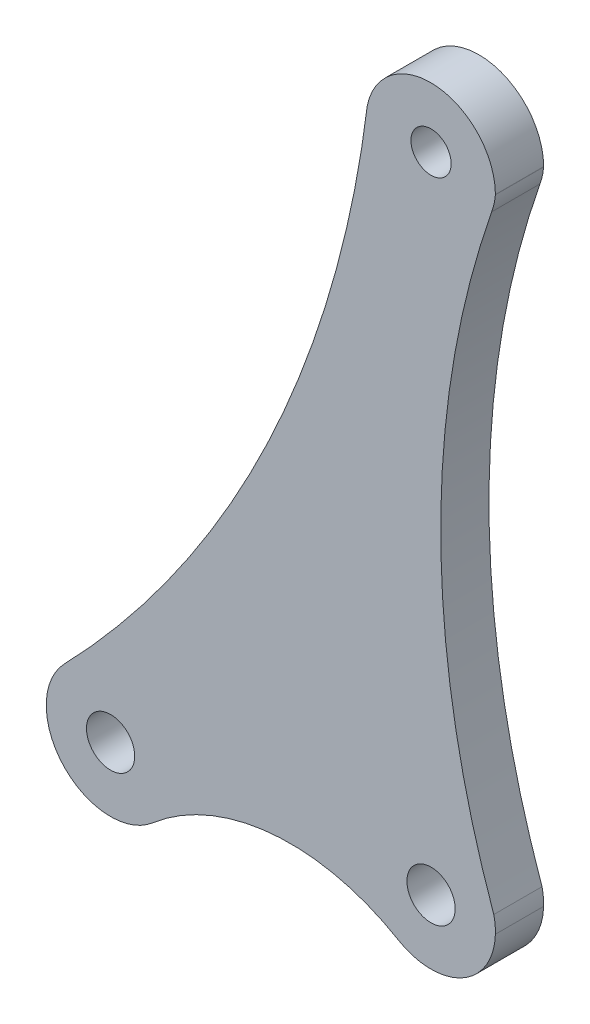
ISO-10303-21;
HEADER;
FILE_DESCRIPTION(('STEP AP214'),'2;1');
FILE_NAME('part.step','',(''),(''),'','','');
FILE_SCHEMA(('AUTOMOTIVE_DESIGN { 1 0 10303 214 1 1 1 1 }'));
ENDSEC;
DATA;
#1=APPLICATION_CONTEXT('core data for automotive mechanical design processes');
#2=APPLICATION_PROTOCOL_DEFINITION('international standard','automotive_design',2000,#1);
#3=PRODUCT_CONTEXT('',#1,'mechanical');
#4=PRODUCT('Part','Part','',(#3));
#5=PRODUCT_RELATED_PRODUCT_CATEGORY('part','',(#4));
#6=PRODUCT_DEFINITION_FORMATION('','',#4);
#7=PRODUCT_DEFINITION_CONTEXT('part definition',#1,'design');
#8=PRODUCT_DEFINITION('design','',#6,#7);
#9=PRODUCT_DEFINITION_SHAPE('','',#8);
#10=(LENGTH_UNIT() NAMED_UNIT(*) SI_UNIT(.MILLI.,.METRE.));
#11=(NAMED_UNIT(*) PLANE_ANGLE_UNIT() SI_UNIT($,.RADIAN.));
#12=(NAMED_UNIT(*) SI_UNIT($,.STERADIAN.) SOLID_ANGLE_UNIT());
#13=UNCERTAINTY_MEASURE_WITH_UNIT(LENGTH_MEASURE(1.E-05),#10,'distance_accuracy_value','');
#14=(GEOMETRIC_REPRESENTATION_CONTEXT(3) GLOBAL_UNCERTAINTY_ASSIGNED_CONTEXT((#13)) GLOBAL_UNIT_ASSIGNED_CONTEXT((#10,
#11,#12)) REPRESENTATION_CONTEXT('',''));
#15=CARTESIAN_POINT('',(0.,0.,0.));
#16=DIRECTION('',(0.,0.,1.));
#17=DIRECTION('',(1.,0.,0.));
#18=AXIS2_PLACEMENT_3D('',#15,#16,#17);
#19=CARTESIAN_POINT('',(2166.51564922467,1590.35932652657,3.));
#20=DIRECTION('',(0.,0.,1.));
#21=DIRECTION('',(1.,0.,0.));
#22=AXIS2_PLACEMENT_3D('',#19,#20,#21);
#23=PLANE('',#22);
#24=CARTESIAN_POINT('',(2186.43959387212,1592.10228841253,3.));
#25=DIRECTION('',(0.,0.,1.));
#26=DIRECTION('',(1.,0.,0.));
#27=AXIS2_PLACEMENT_3D('',#24,#25,#26);
#28=CIRCLE('',#27,1.50000000000011);
#29=CARTESIAN_POINT('',(2187.93959387212,1592.10228841253,3.));
#30=VERTEX_POINT('',#29);
#31=EDGE_CURVE('E310',#30,#30,#28,.T.);
#32=ORIENTED_EDGE('',*,*,#31,.F.);
#33=EDGE_LOOP('',(#32));
#34=FACE_BOUND('',#33,.T.);
#35=CARTESIAN_POINT('',(2166.51561549755,1590.35926949553,3.));
#36=DIRECTION('',(0.,0.,1.));
#37=DIRECTION('',(1.,0.,0.));
#38=AXIS2_PLACEMENT_3D('',#35,#36,#37);
#39=CIRCLE('',#38,3.99995557073102);
#40=CARTESIAN_POINT('',(2163.63933697027,1593.13895767973,3.));
#41=VERTEX_POINT('',#40);
#42=CARTESIAN_POINT('',(2165.28484492983,1586.5533729681,3.));
#43=VERTEX_POINT('',#42);
#44=EDGE_CURVE('E191',#41,#43,#39,.T.);
#45=ORIENTED_EDGE('',*,*,#44,.T.);
#46=CARTESIAN_POINT('',(2166.5156829518,1590.35938355762,3.));
#47=DIRECTION('',(0.,0.,1.));
#48=DIRECTION('',(1.,0.,0.));
#49=AXIS2_PLACEMENT_3D('',#46,#47,#48);
#50=CIRCLE('',#49,4.00008485457964);
#51=CARTESIAN_POINT('',(2166.26470953821,1586.36717975652,3.));
#52=VERTEX_POINT('',#51);
#53=EDGE_CURVE('E109',#43,#52,#50,.T.);
#54=ORIENTED_EDGE('',*,*,#53,.T.);
#55=CARTESIAN_POINT('',(2166.51567116008,1590.35932150316,3.));
#56=DIRECTION('',(0.,0.,1.));
#57=DIRECTION('',(1.,0.,0.));
#58=AXIS2_PLACEMENT_3D('',#55,#56,#57);
#59=CIRCLE('',#58,4.00002218255141);
#60=CARTESIAN_POINT('',(2169.12214239934,1587.32510247023,3.));
#61=VERTEX_POINT('',#60);
#62=EDGE_CURVE('E224',#52,#61,#59,.T.);
#63=ORIENTED_EDGE('',*,*,#62,.T.);
#64=CARTESIAN_POINT('',(2177.69207682142,1577.34922461556,3.));
#65=DIRECTION('',(0.,0.,-1.));
#66=DIRECTION('',(1.,0.,0.));
#67=AXIS2_PLACEMENT_3D('',#64,#65,#66);
#68=CIRCLE('',#67,13.1514985826706);
#69=CARTESIAN_POINT('',(2184.39948642041,1588.66172086712,3.));
#70=VERTEX_POINT('',#69);
#71=EDGE_CURVE('E244',#61,#70,#68,.T.);
#72=ORIENTED_EDGE('',*,*,#71,.T.);
#73=CARTESIAN_POINT('',(2186.43997622529,1592.10454572208,3.));
#74=DIRECTION('',(0.,0.,1.));
#75=DIRECTION('',(1.,0.,0.));
#76=AXIS2_PLACEMENT_3D('',#73,#74,#75);
#77=CIRCLE('',#76,4.00207966259663);
#78=CARTESIAN_POINT('',(2190.44035000705,1591.98770723522,3.));
#79=VERTEX_POINT('',#78);
#80=EDGE_CURVE('E240',#70,#79,#77,.T.);
#81=ORIENTED_EDGE('',*,*,#80,.T.);
#82=CARTESIAN_POINT('',(2186.43955065192,1592.10247620143,3.));
#83=DIRECTION('',(0.,0.,1.));
#84=DIRECTION('',(1.,0.,0.));
#85=AXIS2_PLACEMENT_3D('',#82,#83,#84);
#86=CIRCLE('',#85,4.0024451770855);
#87=CARTESIAN_POINT('',(2190.34004545616,1593.00008841039,3.));
#88=VERTEX_POINT('',#87);
#89=EDGE_CURVE('E243',#79,#88,#86,.T.);
#90=ORIENTED_EDGE('',*,*,#89,.T.);
#91=CARTESIAN_POINT('',(2243.80207840162,1612.06747574487,3.));
#92=DIRECTION('',(0.,0.,-1.));
#93=DIRECTION('',(1.,0.,0.));
#94=AXIS2_PLACEMENT_3D('',#91,#92,#93);
#95=CIRCLE('',#94,56.7604988211369);
#96=CARTESIAN_POINT('',(2190.21180157483,1630.77139127217,3.));
#97=VERTEX_POINT('',#96);
#98=EDGE_CURVE('E248',#88,#97,#95,.T.);
#99=ORIENTED_EDGE('',*,*,#98,.T.);
#100=CARTESIAN_POINT('',(2186.43211129498,1632.15147021275,3.));
#101=DIRECTION('',(0.,0.,1.));
#102=DIRECTION('',(1.,0.,0.));
#103=AXIS2_PLACEMENT_3D('',#100,#101,#102);
#104=CIRCLE('',#103,4.02376397094073);
#105=CARTESIAN_POINT('',(2190.4405541763,1631.8006680449,3.));
#106=VERTEX_POINT('',#105);
#107=EDGE_CURVE('E137',#97,#106,#104,.T.);
#108=ORIENTED_EDGE('',*,*,#107,.T.);
#109=CARTESIAN_POINT('',(2190.3430415378,1631.80920194347,3.));
#110=DIRECTION('',(0.,0.,1.));
#111=DIRECTION('',(-1.,0.,0.));
#112=AXIS2_PLACEMENT_3D('',#109,#110,#111);
#113=CIRCLE('',#112,0.0978853517741694);
#114=CARTESIAN_POINT('',(2190.4405541763,1631.81773584204,3.));
#115=VERTEX_POINT('',#114);
#116=EDGE_CURVE('E131',#106,#115,#113,.T.);
#117=ORIENTED_EDGE('',*,*,#116,.T.);
#118=CARTESIAN_POINT('',(2186.41679925504,1631.80920194346,3.));
#119=DIRECTION('',(0.,0.,1.));
#120=DIRECTION('',(1.,0.,0.));
#121=AXIS2_PLACEMENT_3D('',#118,#119,#120);
#122=CIRCLE('',#121,4.02376397094032);
#123=CARTESIAN_POINT('',(2182.46970368957,1632.59093916972,3.));
#124=VERTEX_POINT('',#123);
#125=EDGE_CURVE('E135',#115,#124,#122,.T.);
#126=ORIENTED_EDGE('',*,*,#125,.T.);
#127=CARTESIAN_POINT('',(2114.09650632209,1641.00551279893,3.));
#128=DIRECTION('',(0.,0.,-1.));
#129=DIRECTION('',(1.,0.,0.));
#130=AXIS2_PLACEMENT_3D('',#127,#128,#129);
#131=CIRCLE('',#130,68.8890351769731);
#132=EDGE_CURVE('E57',#124,#41,#131,.T.);
#133=ORIENTED_EDGE('',*,*,#132,.T.);
#134=EDGE_LOOP('',(#45,#54,#63,#72,#81,#90,#99,#108,#117,#126,#133));
#135=FACE_BOUND('',#134,.T.);
#136=CARTESIAN_POINT('',(2166.51565662402,1590.35938521265,3.));
#137=DIRECTION('',(0.,0.,1.));
#138=DIRECTION('',(1.,0.,0.));
#139=AXIS2_PLACEMENT_3D('',#136,#137,#138);
#140=CIRCLE('',#139,1.50000000000011);
#141=CARTESIAN_POINT('',(2168.01565662402,1590.35938521265,3.));
#142=VERTEX_POINT('',#141);
#143=EDGE_CURVE('E164',#142,#142,#140,.T.);
#144=ORIENTED_EDGE('',*,*,#143,.F.);
#145=EDGE_LOOP('',(#144));
#146=FACE_BOUND('',#145,.T.);
#147=CARTESIAN_POINT('',(2186.43971661617,1632.1023319251,3.));
#148=DIRECTION('',(0.,0.,1.));
#149=DIRECTION('',(1.,0.,0.));
#150=AXIS2_PLACEMENT_3D('',#147,#148,#149);
#151=CIRCLE('',#150,1.25000000000008);
#152=CARTESIAN_POINT('',(2187.68971661617,1632.1023319251,3.));
#153=VERTEX_POINT('',#152);
#154=EDGE_CURVE('E299',#153,#153,#151,.T.);
#155=ORIENTED_EDGE('',*,*,#154,.F.);
#156=EDGE_LOOP('',(#155));
#157=FACE_BOUND('',#156,.T.);
#158=ADVANCED_FACE('F39',(#34,#135,#146,#157),#23,.T.);
#159=CARTESIAN_POINT('',(2166.51564922467,1590.35932652657,0.));
#160=DIRECTION('',(0.,0.,1.));
#161=DIRECTION('',(1.,0.,0.));
#162=AXIS2_PLACEMENT_3D('',#159,#160,#161);
#163=PLANE('',#162);
#164=CARTESIAN_POINT('',(2166.51561549755,1590.35926949553,0.));
#165=DIRECTION('',(0.,0.,1.));
#166=DIRECTION('',(1.,0.,0.));
#167=AXIS2_PLACEMENT_3D('',#164,#165,#166);
#168=CIRCLE('',#167,3.99995557073102);
#169=CARTESIAN_POINT('',(2163.63933697027,1593.13895767973,0.));
#170=VERTEX_POINT('',#169);
#171=CARTESIAN_POINT('',(2165.28484492983,1586.5533729681,0.));
#172=VERTEX_POINT('',#171);
#173=EDGE_CURVE('E159',#170,#172,#168,.T.);
#174=ORIENTED_EDGE('',*,*,#173,.F.);
#175=CARTESIAN_POINT('',(2114.09650632209,1641.00551279893,0.));
#176=DIRECTION('',(0.,0.,-1.));
#177=DIRECTION('',(1.,0.,0.));
#178=AXIS2_PLACEMENT_3D('',#175,#176,#177);
#179=CIRCLE('',#178,68.8890351769731);
#180=CARTESIAN_POINT('',(2182.46970368957,1632.59093916972,0.));
#181=VERTEX_POINT('',#180);
#182=EDGE_CURVE('E101',#181,#170,#179,.T.);
#183=ORIENTED_EDGE('',*,*,#182,.F.);
#184=CARTESIAN_POINT('',(2186.41679925504,1631.80920194346,0.));
#185=DIRECTION('',(0.,0.,1.));
#186=DIRECTION('',(1.,0.,0.));
#187=AXIS2_PLACEMENT_3D('',#184,#185,#186);
#188=CIRCLE('',#187,4.02376397094032);
#189=CARTESIAN_POINT('',(2190.4405541763,1631.81773584204,0.));
#190=VERTEX_POINT('',#189);
#191=EDGE_CURVE('E95',#190,#181,#188,.T.);
#192=ORIENTED_EDGE('',*,*,#191,.F.);
#193=CARTESIAN_POINT('',(2190.3430415378,1631.80920194347,0.));
#194=DIRECTION('',(0.,0.,1.));
#195=DIRECTION('',(-1.,0.,0.));
#196=AXIS2_PLACEMENT_3D('',#193,#194,#195);
#197=CIRCLE('',#196,0.0978853517741694);
#198=CARTESIAN_POINT('',(2190.4405541763,1631.8006680449,0.));
#199=VERTEX_POINT('',#198);
#200=EDGE_CURVE('E146',#199,#190,#197,.T.);
#201=ORIENTED_EDGE('',*,*,#200,.F.);
#202=CARTESIAN_POINT('',(2186.43211129498,1632.15147021275,0.));
#203=DIRECTION('',(0.,0.,1.));
#204=DIRECTION('',(1.,0.,0.));
#205=AXIS2_PLACEMENT_3D('',#202,#203,#204);
#206=CIRCLE('',#205,4.02376397094073);
#207=CARTESIAN_POINT('',(2190.21180157483,1630.77139127217,0.));
#208=VERTEX_POINT('',#207);
#209=EDGE_CURVE('E182',#208,#199,#206,.T.);
#210=ORIENTED_EDGE('',*,*,#209,.F.);
#211=CARTESIAN_POINT('',(2243.80207840162,1612.06747574487,0.));
#212=DIRECTION('',(0.,0.,-1.));
#213=DIRECTION('',(1.,0.,0.));
#214=AXIS2_PLACEMENT_3D('',#211,#212,#213);
#215=CIRCLE('',#214,56.7604988211369);
#216=CARTESIAN_POINT('',(2190.34004545616,1593.00008841039,0.));
#217=VERTEX_POINT('',#216);
#218=EDGE_CURVE('E179',#217,#208,#215,.T.);
#219=ORIENTED_EDGE('',*,*,#218,.F.);
#220=CARTESIAN_POINT('',(2186.43955065192,1592.10247620143,0.));
#221=DIRECTION('',(0.,0.,1.));
#222=DIRECTION('',(1.,0.,0.));
#223=AXIS2_PLACEMENT_3D('',#220,#221,#222);
#224=CIRCLE('',#223,4.0024451770855);
#225=CARTESIAN_POINT('',(2190.44035000705,1591.98770723522,0.));
#226=VERTEX_POINT('',#225);
#227=EDGE_CURVE('E176',#226,#217,#224,.T.);
#228=ORIENTED_EDGE('',*,*,#227,.F.);
#229=CARTESIAN_POINT('',(2186.43997622529,1592.10454572208,0.));
#230=DIRECTION('',(0.,0.,1.));
#231=DIRECTION('',(1.,0.,0.));
#232=AXIS2_PLACEMENT_3D('',#229,#230,#231);
#233=CIRCLE('',#232,4.00207966259663);
#234=CARTESIAN_POINT('',(2184.39948642041,1588.66172086712,0.));
#235=VERTEX_POINT('',#234);
#236=EDGE_CURVE('E173',#235,#226,#233,.T.);
#237=ORIENTED_EDGE('',*,*,#236,.F.);
#238=CARTESIAN_POINT('',(2177.69207682142,1577.34922461556,0.));
#239=DIRECTION('',(0.,0.,-1.));
#240=DIRECTION('',(1.,0.,0.));
#241=AXIS2_PLACEMENT_3D('',#238,#239,#240);
#242=CIRCLE('',#241,13.1514985826706);
#243=CARTESIAN_POINT('',(2169.12214239934,1587.32510247023,0.));
#244=VERTEX_POINT('',#243);
#245=EDGE_CURVE('E170',#244,#235,#242,.T.);
#246=ORIENTED_EDGE('',*,*,#245,.F.);
#247=CARTESIAN_POINT('',(2166.51567116008,1590.35932150316,0.));
#248=DIRECTION('',(0.,0.,1.));
#249=DIRECTION('',(1.,0.,0.));
#250=AXIS2_PLACEMENT_3D('',#247,#248,#249);
#251=CIRCLE('',#250,4.00002218255141);
#252=CARTESIAN_POINT('',(2166.26470953821,1586.36717975652,0.));
#253=VERTEX_POINT('',#252);
#254=EDGE_CURVE('E167',#253,#244,#251,.T.);
#255=ORIENTED_EDGE('',*,*,#254,.F.);
#256=CARTESIAN_POINT('',(2166.5156829518,1590.35938355762,0.));
#257=DIRECTION('',(0.,0.,1.));
#258=DIRECTION('',(1.,0.,0.));
#259=AXIS2_PLACEMENT_3D('',#256,#257,#258);
#260=CIRCLE('',#259,4.00008485457964);
#261=EDGE_CURVE('E163',#172,#253,#260,.T.);
#262=ORIENTED_EDGE('',*,*,#261,.F.);
#263=EDGE_LOOP('',(#174,#183,#192,#201,#210,#219,#228,#237,#246,#255,#262));
#264=FACE_BOUND('',#263,.T.);
#265=CARTESIAN_POINT('',(2166.51565662402,1590.35938521265,0.));
#266=DIRECTION('',(0.,0.,1.));
#267=DIRECTION('',(1.,0.,0.));
#268=AXIS2_PLACEMENT_3D('',#265,#266,#267);
#269=CIRCLE('',#268,1.50000000000011);
#270=CARTESIAN_POINT('',(2168.01565662402,1590.35938521265,0.));
#271=VERTEX_POINT('',#270);
#272=EDGE_CURVE('E314',#271,#271,#269,.T.);
#273=ORIENTED_EDGE('',*,*,#272,.T.);
#274=EDGE_LOOP('',(#273));
#275=FACE_BOUND('',#274,.T.);
#276=CARTESIAN_POINT('',(2186.43959387212,1592.10228841253,0.));
#277=DIRECTION('',(0.,0.,1.));
#278=DIRECTION('',(1.,0.,0.));
#279=AXIS2_PLACEMENT_3D('',#276,#277,#278);
#280=CIRCLE('',#279,1.50000000000011);
#281=CARTESIAN_POINT('',(2187.93959387212,1592.10228841253,0.));
#282=VERTEX_POINT('',#281);
#283=EDGE_CURVE('E307',#282,#282,#280,.T.);
#284=ORIENTED_EDGE('',*,*,#283,.T.);
#285=EDGE_LOOP('',(#284));
#286=FACE_BOUND('',#285,.T.);
#287=CARTESIAN_POINT('',(2186.43971661617,1632.1023319251,0.));
#288=DIRECTION('',(0.,0.,1.));
#289=DIRECTION('',(1.,0.,0.));
#290=AXIS2_PLACEMENT_3D('',#287,#288,#289);
#291=CIRCLE('',#290,1.25000000000008);
#292=CARTESIAN_POINT('',(2187.68971661617,1632.1023319251,0.));
#293=VERTEX_POINT('',#292);
#294=EDGE_CURVE('E302',#293,#293,#291,.T.);
#295=ORIENTED_EDGE('',*,*,#294,.T.);
#296=EDGE_LOOP('',(#295));
#297=FACE_BOUND('',#296,.T.);
#298=ADVANCED_FACE('F228',(#264,#275,#286,#297),#163,.F.);
#299=CARTESIAN_POINT('',(2166.51561549755,1590.35926949553,3.));
#300=DIRECTION('',(0.,0.,-1.));
#301=DIRECTION('',(-1.,0.,0.));
#302=AXIS2_PLACEMENT_3D('',#299,#300,#301);
#303=CYLINDRICAL_SURFACE('',#302,3.99995557073102);
#304=ORIENTED_EDGE('',*,*,#173,.T.);
#305=DIRECTION('',(0.,0.,-1.));
#306=VECTOR('',#305,1.);
#307=CARTESIAN_POINT('',(2165.28484492983,1586.5533729681,3.));
#308=LINE('',#307,#306);
#309=EDGE_CURVE('E11',#43,#172,#308,.T.);
#310=ORIENTED_EDGE('',*,*,#309,.F.);
#311=ORIENTED_EDGE('',*,*,#44,.F.);
#312=DIRECTION('',(0.,0.,-1.));
#313=VECTOR('',#312,1.);
#314=CARTESIAN_POINT('',(2163.63933697027,1593.13895767973,3.));
#315=LINE('',#314,#313);
#316=EDGE_CURVE('E155',#41,#170,#315,.T.);
#317=ORIENTED_EDGE('',*,*,#316,.T.);
#318=EDGE_LOOP('',(#304,#310,#311,#317));
#319=FACE_BOUND('',#318,.T.);
#320=ADVANCED_FACE('F41',(#319),#303,.T.);
#321=CARTESIAN_POINT('',(2166.5156829518,1590.35938355762,3.));
#322=DIRECTION('',(0.,0.,-1.));
#323=DIRECTION('',(-1.,0.,0.));
#324=AXIS2_PLACEMENT_3D('',#321,#322,#323);
#325=CYLINDRICAL_SURFACE('',#324,4.00008485457964);
#326=ORIENTED_EDGE('',*,*,#261,.T.);
#327=DIRECTION('',(0.,0.,-1.));
#328=VECTOR('',#327,1.);
#329=CARTESIAN_POINT('',(2166.26470953821,1586.36717975652,3.));
#330=LINE('',#329,#328);
#331=EDGE_CURVE('E49',#52,#253,#330,.T.);
#332=ORIENTED_EDGE('',*,*,#331,.F.);
#333=ORIENTED_EDGE('',*,*,#53,.F.);
#334=ORIENTED_EDGE('',*,*,#309,.T.);
#335=EDGE_LOOP('',(#326,#332,#333,#334));
#336=FACE_BOUND('',#335,.T.);
#337=ADVANCED_FACE('F412',(#336),#325,.T.);
#338=CARTESIAN_POINT('',(2166.51567116008,1590.35932150316,3.));
#339=DIRECTION('',(0.,0.,-1.));
#340=DIRECTION('',(-1.,0.,0.));
#341=AXIS2_PLACEMENT_3D('',#338,#339,#340);
#342=CYLINDRICAL_SURFACE('',#341,4.00002218255141);
#343=ORIENTED_EDGE('',*,*,#254,.T.);
#344=DIRECTION('',(0.,0.,-1.));
#345=VECTOR('',#344,1.);
#346=CARTESIAN_POINT('',(2169.12214239934,1587.32510247023,3.));
#347=LINE('',#346,#345);
#348=EDGE_CURVE('E214',#61,#244,#347,.T.);
#349=ORIENTED_EDGE('',*,*,#348,.F.);
#350=ORIENTED_EDGE('',*,*,#62,.F.);
#351=ORIENTED_EDGE('',*,*,#331,.T.);
#352=EDGE_LOOP('',(#343,#349,#350,#351));
#353=FACE_BOUND('',#352,.T.);
#354=ADVANCED_FACE('F222',(#353),#342,.T.);
#355=CARTESIAN_POINT('',(2177.69207682142,1577.34922461556,3.));
#356=DIRECTION('',(0.,0.,-1.));
#357=DIRECTION('',(-1.,0.,0.));
#358=AXIS2_PLACEMENT_3D('',#355,#356,#357);
#359=CYLINDRICAL_SURFACE('',#358,13.1514985826706);
#360=ORIENTED_EDGE('',*,*,#245,.T.);
#361=DIRECTION('',(0.,0.,-1.));
#362=VECTOR('',#361,1.);
#363=CARTESIAN_POINT('',(2184.39948642041,1588.66172086712,3.));
#364=LINE('',#363,#362);
#365=EDGE_CURVE('E210',#70,#235,#364,.T.);
#366=ORIENTED_EDGE('',*,*,#365,.F.);
#367=ORIENTED_EDGE('',*,*,#71,.F.);
#368=ORIENTED_EDGE('',*,*,#348,.T.);
#369=EDGE_LOOP('',(#360,#366,#367,#368));
#370=FACE_BOUND('',#369,.T.);
#371=ADVANCED_FACE('F234',(#370),#359,.F.);
#372=CARTESIAN_POINT('',(2186.43997622529,1592.10454572208,3.));
#373=DIRECTION('',(0.,0.,-1.));
#374=DIRECTION('',(-1.,0.,0.));
#375=AXIS2_PLACEMENT_3D('',#372,#373,#374);
#376=CYLINDRICAL_SURFACE('',#375,4.00207966259663);
#377=ORIENTED_EDGE('',*,*,#236,.T.);
#378=DIRECTION('',(0.,0.,-1.));
#379=VECTOR('',#378,1.);
#380=CARTESIAN_POINT('',(2190.44035000705,1591.98770723522,3.));
#381=LINE('',#380,#379);
#382=EDGE_CURVE('E206',#79,#226,#381,.T.);
#383=ORIENTED_EDGE('',*,*,#382,.F.);
#384=ORIENTED_EDGE('',*,*,#80,.F.);
#385=ORIENTED_EDGE('',*,*,#365,.T.);
#386=EDGE_LOOP('',(#377,#383,#384,#385));
#387=FACE_BOUND('',#386,.T.);
#388=ADVANCED_FACE('F238',(#387),#376,.T.);
#389=CARTESIAN_POINT('',(2186.43955065192,1592.10247620143,3.));
#390=DIRECTION('',(0.,0.,-1.));
#391=DIRECTION('',(-1.,0.,0.));
#392=AXIS2_PLACEMENT_3D('',#389,#390,#391);
#393=CYLINDRICAL_SURFACE('',#392,4.0024451770855);
#394=ORIENTED_EDGE('',*,*,#227,.T.);
#395=DIRECTION('',(0.,0.,-1.));
#396=VECTOR('',#395,1.);
#397=CARTESIAN_POINT('',(2190.34004545616,1593.00008841039,3.));
#398=LINE('',#397,#396);
#399=EDGE_CURVE('E202',#88,#217,#398,.T.);
#400=ORIENTED_EDGE('',*,*,#399,.F.);
#401=ORIENTED_EDGE('',*,*,#89,.F.);
#402=ORIENTED_EDGE('',*,*,#382,.T.);
#403=EDGE_LOOP('',(#394,#400,#401,#402));
#404=FACE_BOUND('',#403,.T.);
#405=ADVANCED_FACE('F378',(#404),#393,.T.);
#406=CARTESIAN_POINT('',(2243.80207840162,1612.06747574487,3.));
#407=DIRECTION('',(0.,0.,-1.));
#408=DIRECTION('',(-1.,0.,0.));
#409=AXIS2_PLACEMENT_3D('',#406,#407,#408);
#410=CYLINDRICAL_SURFACE('',#409,56.7604988211369);
#411=ORIENTED_EDGE('',*,*,#218,.T.);
#412=DIRECTION('',(0.,0.,-1.));
#413=VECTOR('',#412,1.);
#414=CARTESIAN_POINT('',(2190.21180157483,1630.77139127217,3.));
#415=LINE('',#414,#413);
#416=EDGE_CURVE('E198',#97,#208,#415,.T.);
#417=ORIENTED_EDGE('',*,*,#416,.F.);
#418=ORIENTED_EDGE('',*,*,#98,.F.);
#419=ORIENTED_EDGE('',*,*,#399,.T.);
#420=EDGE_LOOP('',(#411,#417,#418,#419));
#421=FACE_BOUND('',#420,.T.);
#422=ADVANCED_FACE('F259',(#421),#410,.F.);
#423=CARTESIAN_POINT('',(2186.43211129498,1632.15147021275,3.));
#424=DIRECTION('',(0.,0.,-1.));
#425=DIRECTION('',(-1.,0.,0.));
#426=AXIS2_PLACEMENT_3D('',#423,#424,#425);
#427=CYLINDRICAL_SURFACE('',#426,4.02376397094073);
#428=ORIENTED_EDGE('',*,*,#209,.T.);
#429=DIRECTION('',(0.,0.,-1.));
#430=VECTOR('',#429,1.);
#431=CARTESIAN_POINT('',(2190.4405541763,1631.8006680449,3.));
#432=LINE('',#431,#430);
#433=EDGE_CURVE('E148',#106,#199,#432,.T.);
#434=ORIENTED_EDGE('',*,*,#433,.F.);
#435=ORIENTED_EDGE('',*,*,#107,.F.);
#436=ORIENTED_EDGE('',*,*,#416,.T.);
#437=EDGE_LOOP('',(#428,#434,#435,#436));
#438=FACE_BOUND('',#437,.T.);
#439=ADVANCED_FACE('F263',(#438),#427,.T.);
#440=CARTESIAN_POINT('',(2190.3430415378,1631.80920194347,3.));
#441=DIRECTION('',(0.,0.,-1.));
#442=DIRECTION('',(-1.,0.,0.));
#443=AXIS2_PLACEMENT_3D('',#440,#441,#442);
#444=CYLINDRICAL_SURFACE('',#443,0.0978853517741694);
#445=ORIENTED_EDGE('',*,*,#200,.T.);
#446=DIRECTION('',(0.,0.,-1.));
#447=VECTOR('',#446,1.);
#448=CARTESIAN_POINT('',(2190.4405541763,1631.81773584204,3.));
#449=LINE('',#448,#447);
#450=EDGE_CURVE('E143',#115,#190,#449,.T.);
#451=ORIENTED_EDGE('',*,*,#450,.F.);
#452=ORIENTED_EDGE('',*,*,#116,.F.);
#453=ORIENTED_EDGE('',*,*,#433,.T.);
#454=EDGE_LOOP('',(#445,#451,#452,#453));
#455=FACE_BOUND('',#454,.T.);
#456=ADVANCED_FACE('F144',(#455),#444,.T.);
#457=CARTESIAN_POINT('',(2186.41679925504,1631.80920194346,3.));
#458=DIRECTION('',(0.,0.,-1.));
#459=DIRECTION('',(-1.,0.,0.));
#460=AXIS2_PLACEMENT_3D('',#457,#458,#459);
#461=CYLINDRICAL_SURFACE('',#460,4.02376397094032);
#462=ORIENTED_EDGE('',*,*,#191,.T.);
#463=DIRECTION('',(0.,0.,-1.));
#464=VECTOR('',#463,1.);
#465=CARTESIAN_POINT('',(2182.46970368957,1632.59093916972,3.));
#466=LINE('',#465,#464);
#467=EDGE_CURVE('E149',#124,#181,#466,.T.);
#468=ORIENTED_EDGE('',*,*,#467,.F.);
#469=ORIENTED_EDGE('',*,*,#125,.F.);
#470=ORIENTED_EDGE('',*,*,#450,.T.);
#471=EDGE_LOOP('',(#462,#468,#469,#470));
#472=FACE_BOUND('',#471,.T.);
#473=ADVANCED_FACE('F151',(#472),#461,.T.);
#474=CARTESIAN_POINT('',(2114.09650632209,1641.00551279893,3.));
#475=DIRECTION('',(0.,0.,-1.));
#476=DIRECTION('',(-1.,0.,0.));
#477=AXIS2_PLACEMENT_3D('',#474,#475,#476);
#478=CYLINDRICAL_SURFACE('',#477,68.8890351769731);
#479=ORIENTED_EDGE('',*,*,#182,.T.);
#480=ORIENTED_EDGE('',*,*,#316,.F.);
#481=ORIENTED_EDGE('',*,*,#132,.F.);
#482=ORIENTED_EDGE('',*,*,#467,.T.);
#483=EDGE_LOOP('',(#479,#480,#481,#482));
#484=FACE_BOUND('',#483,.T.);
#485=ADVANCED_FACE('F267',(#484),#478,.F.);
#486=CARTESIAN_POINT('',(2166.51565662402,1590.35938521265,3.));
#487=DIRECTION('',(0.,0.,-1.));
#488=DIRECTION('',(-1.,0.,0.));
#489=AXIS2_PLACEMENT_3D('',#486,#487,#488);
#490=CYLINDRICAL_SURFACE('',#489,1.50000000000011);
#491=ORIENTED_EDGE('',*,*,#143,.T.);
#492=EDGE_LOOP('',(#491));
#493=FACE_BOUND('',#492,.T.);
#494=ORIENTED_EDGE('',*,*,#272,.F.);
#495=EDGE_LOOP('',(#494));
#496=FACE_BOUND('',#495,.T.);
#497=ADVANCED_FACE('F269',(#493,#496),#490,.F.);
#498=CARTESIAN_POINT('',(2186.43959387212,1592.10228841253,3.));
#499=DIRECTION('',(0.,0.,-1.));
#500=DIRECTION('',(-1.,0.,0.));
#501=AXIS2_PLACEMENT_3D('',#498,#499,#500);
#502=CYLINDRICAL_SURFACE('',#501,1.50000000000011);
#503=ORIENTED_EDGE('',*,*,#31,.T.);
#504=EDGE_LOOP('',(#503));
#505=FACE_BOUND('',#504,.T.);
#506=ORIENTED_EDGE('',*,*,#283,.F.);
#507=EDGE_LOOP('',(#506));
#508=FACE_BOUND('',#507,.T.);
#509=ADVANCED_FACE('F275',(#505,#508),#502,.F.);
#510=CARTESIAN_POINT('',(2186.43971661617,1632.1023319251,3.));
#511=DIRECTION('',(0.,0.,-1.));
#512=DIRECTION('',(-1.,0.,0.));
#513=AXIS2_PLACEMENT_3D('',#510,#511,#512);
#514=CYLINDRICAL_SURFACE('',#513,1.25000000000008);
#515=ORIENTED_EDGE('',*,*,#154,.T.);
#516=EDGE_LOOP('',(#515));
#517=FACE_BOUND('',#516,.T.);
#518=ORIENTED_EDGE('',*,*,#294,.F.);
#519=EDGE_LOOP('',(#518));
#520=FACE_BOUND('',#519,.T.);
#521=ADVANCED_FACE('F290',(#517,#520),#514,.F.);
#522=CLOSED_SHELL('',(#158,#298,#320,#337,#354,#371,#388,#405,#422,#439,#456,#473,#485,#497,
#509,#521));
#523=MANIFOLD_SOLID_BREP('B2',#522);
#524=ADVANCED_BREP_SHAPE_REPRESENTATION('',(#18,#523),#14);
#525=SHAPE_DEFINITION_REPRESENTATION(#9,#524);
ENDSEC;
END-ISO-10303-21;
